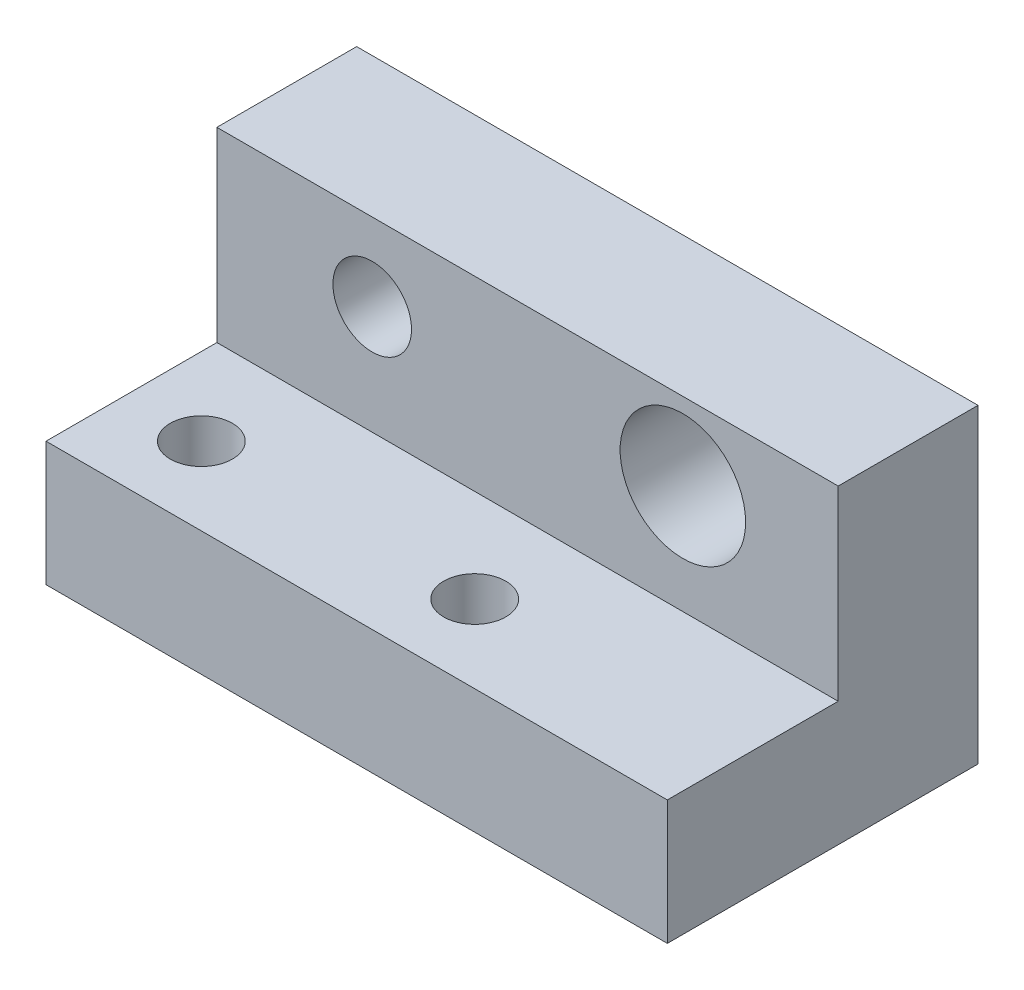
ISO-10303-21;
HEADER;
FILE_DESCRIPTION(('STEP AP214'),'2;1');
FILE_NAME('part.step','',(''),(''),'','','');
FILE_SCHEMA(('AUTOMOTIVE_DESIGN { 1 0 10303 214 1 1 1 1 }'));
ENDSEC;
DATA;
#1=APPLICATION_CONTEXT('core data for automotive mechanical design processes');
#2=APPLICATION_PROTOCOL_DEFINITION('international standard','automotive_design',2000,#1);
#3=PRODUCT_CONTEXT('',#1,'mechanical');
#4=PRODUCT('Part','Part','',(#3));
#5=PRODUCT_RELATED_PRODUCT_CATEGORY('part','',(#4));
#6=PRODUCT_DEFINITION_FORMATION('','',#4);
#7=PRODUCT_DEFINITION_CONTEXT('part definition',#1,'design');
#8=PRODUCT_DEFINITION('design','',#6,#7);
#9=PRODUCT_DEFINITION_SHAPE('','',#8);
#10=(LENGTH_UNIT() NAMED_UNIT(*) SI_UNIT(.MILLI.,.METRE.));
#11=(NAMED_UNIT(*) PLANE_ANGLE_UNIT() SI_UNIT($,.RADIAN.));
#12=(NAMED_UNIT(*) SI_UNIT($,.STERADIAN.) SOLID_ANGLE_UNIT());
#13=UNCERTAINTY_MEASURE_WITH_UNIT(LENGTH_MEASURE(1.E-05),#10,'distance_accuracy_value','');
#14=(GEOMETRIC_REPRESENTATION_CONTEXT(3) GLOBAL_UNCERTAINTY_ASSIGNED_CONTEXT((#13)) GLOBAL_UNIT_ASSIGNED_CONTEXT((#10,
#11,#12)) REPRESENTATION_CONTEXT('',''));
#15=CARTESIAN_POINT('',(0.,0.,0.));
#16=DIRECTION('',(0.,0.,1.));
#17=DIRECTION('',(1.,0.,0.));
#18=AXIS2_PLACEMENT_3D('',#15,#16,#17);
#19=CARTESIAN_POINT('',(-50.8,10.16,0.));
#20=DIRECTION('',(0.,0.,1.));
#21=DIRECTION('',(1.,0.,0.));
#22=AXIS2_PLACEMENT_3D('',#19,#20,#21);
#23=PLANE('',#22);
#24=DIRECTION('',(0.,-1.,0.));
#25=VECTOR('',#24,1.);
#26=CARTESIAN_POINT('',(0.,10.16,0.));
#27=LINE('',#26,#25);
#28=CARTESIAN_POINT('',(0.,10.16,0.));
#29=VERTEX_POINT('',#28);
#30=CARTESIAN_POINT('',(0.,0.,0.));
#31=VERTEX_POINT('',#30);
#32=EDGE_CURVE('E118',#29,#31,#27,.T.);
#33=ORIENTED_EDGE('',*,*,#32,.F.);
#34=DIRECTION('',(1.,0.,0.));
#35=VECTOR('',#34,1.);
#36=CARTESIAN_POINT('',(-50.8,10.16,0.));
#37=LINE('',#36,#35);
#38=CARTESIAN_POINT('',(-50.8,10.16,0.));
#39=VERTEX_POINT('',#38);
#40=EDGE_CURVE('E11',#39,#29,#37,.T.);
#41=ORIENTED_EDGE('',*,*,#40,.F.);
#42=DIRECTION('',(0.,-1.,0.));
#43=VECTOR('',#42,1.);
#44=CARTESIAN_POINT('',(-50.8,10.16,0.));
#45=LINE('',#44,#43);
#46=CARTESIAN_POINT('',(-50.8,0.,0.));
#47=VERTEX_POINT('',#46);
#48=EDGE_CURVE('E133',#39,#47,#45,.T.);
#49=ORIENTED_EDGE('',*,*,#48,.T.);
#50=DIRECTION('',(1.,0.,0.));
#51=VECTOR('',#50,1.);
#52=CARTESIAN_POINT('',(-50.8,0.,0.));
#53=LINE('',#52,#51);
#54=EDGE_CURVE('E82',#47,#31,#53,.T.);
#55=ORIENTED_EDGE('',*,*,#54,.T.);
#56=EDGE_LOOP('',(#33,#41,#49,#55));
#57=FACE_BOUND('',#56,.T.);
#58=ADVANCED_FACE('F32',(#57),#23,.T.);
#59=CARTESIAN_POINT('',(-50.8,10.16,-13.97));
#60=DIRECTION('',(0.,1.,0.));
#61=DIRECTION('',(0.,0.,1.));
#62=AXIS2_PLACEMENT_3D('',#59,#60,#61);
#63=PLANE('',#62);
#64=CARTESIAN_POINT('',(-44.45,10.16,-6.35));
#65=DIRECTION('',(0.,1.,0.));
#66=DIRECTION('',(0.,0.,1.));
#67=AXIS2_PLACEMENT_3D('',#64,#65,#66);
#68=CIRCLE('',#67,2.54);
#69=CARTESIAN_POINT('',(-44.45,10.16,-3.81));
#70=VERTEX_POINT('',#69);
#71=EDGE_CURVE('E156',#70,#70,#68,.T.);
#72=ORIENTED_EDGE('',*,*,#71,.F.);
#73=EDGE_LOOP('',(#72));
#74=FACE_BOUND('',#73,.T.);
#75=CARTESIAN_POINT('',(-22.098,10.16,-6.35));
#76=DIRECTION('',(0.,1.,0.));
#77=DIRECTION('',(0.,0.,1.));
#78=AXIS2_PLACEMENT_3D('',#75,#76,#77);
#79=CIRCLE('',#78,2.54);
#80=CARTESIAN_POINT('',(-22.098,10.16,-3.81));
#81=VERTEX_POINT('',#80);
#82=EDGE_CURVE('E145',#81,#81,#79,.T.);
#83=ORIENTED_EDGE('',*,*,#82,.F.);
#84=EDGE_LOOP('',(#83));
#85=FACE_BOUND('',#84,.T.);
#86=DIRECTION('',(0.,0.,1.));
#87=VECTOR('',#86,1.);
#88=CARTESIAN_POINT('',(0.,10.16,-13.97));
#89=LINE('',#88,#87);
#90=CARTESIAN_POINT('',(0.,10.16,-13.97));
#91=VERTEX_POINT('',#90);
#92=EDGE_CURVE('E131',#91,#29,#89,.T.);
#93=ORIENTED_EDGE('',*,*,#92,.F.);
#94=DIRECTION('',(1.,0.,0.));
#95=VECTOR('',#94,1.);
#96=CARTESIAN_POINT('',(-50.8,10.16,-13.97));
#97=LINE('',#96,#95);
#98=CARTESIAN_POINT('',(-50.8,10.16,-13.97));
#99=VERTEX_POINT('',#98);
#100=EDGE_CURVE('E41',#99,#91,#97,.T.);
#101=ORIENTED_EDGE('',*,*,#100,.F.);
#102=DIRECTION('',(0.,0.,1.));
#103=VECTOR('',#102,1.);
#104=CARTESIAN_POINT('',(-50.8,10.16,-13.97));
#105=LINE('',#104,#103);
#106=EDGE_CURVE('E108',#99,#39,#105,.T.);
#107=ORIENTED_EDGE('',*,*,#106,.T.);
#108=ORIENTED_EDGE('',*,*,#40,.T.);
#109=EDGE_LOOP('',(#93,#101,#107,#108));
#110=FACE_BOUND('',#109,.T.);
#111=ADVANCED_FACE('F168',(#74,#85,#110),#63,.T.);
#112=CARTESIAN_POINT('',(-50.8,25.4,-13.97));
#113=DIRECTION('',(0.,0.,1.));
#114=DIRECTION('',(0.,-1.,0.));
#115=AXIS2_PLACEMENT_3D('',#112,#113,#114);
#116=PLANE('',#115);
#117=CARTESIAN_POINT('',(-38.1,19.05,-13.97));
#118=DIRECTION('',(0.,0.,1.));
#119=DIRECTION('',(1.,0.,0.));
#120=AXIS2_PLACEMENT_3D('',#117,#118,#119);
#121=CIRCLE('',#120,3.2131);
#122=CARTESIAN_POINT('',(-34.8869,19.05,-13.97));
#123=VERTEX_POINT('',#122);
#124=EDGE_CURVE('E141',#123,#123,#121,.T.);
#125=ORIENTED_EDGE('',*,*,#124,.F.);
#126=EDGE_LOOP('',(#125));
#127=FACE_BOUND('',#126,.T.);
#128=CARTESIAN_POINT('',(-12.7,19.05,-13.97));
#129=DIRECTION('',(0.,0.,1.));
#130=DIRECTION('',(1.,0.,0.));
#131=AXIS2_PLACEMENT_3D('',#128,#129,#130);
#132=CIRCLE('',#131,5.1308);
#133=CARTESIAN_POINT('',(-7.5692,19.05,-13.97));
#134=VERTEX_POINT('',#133);
#135=EDGE_CURVE('E147',#134,#134,#132,.T.);
#136=ORIENTED_EDGE('',*,*,#135,.F.);
#137=EDGE_LOOP('',(#136));
#138=FACE_BOUND('',#137,.T.);
#139=DIRECTION('',(0.,-1.,0.));
#140=VECTOR('',#139,1.);
#141=CARTESIAN_POINT('',(0.,25.4,-13.97));
#142=LINE('',#141,#140);
#143=CARTESIAN_POINT('',(0.,25.4,-13.97));
#144=VERTEX_POINT('',#143);
#145=EDGE_CURVE('E95',#144,#91,#142,.T.);
#146=ORIENTED_EDGE('',*,*,#145,.F.);
#147=DIRECTION('',(1.,0.,0.));
#148=VECTOR('',#147,1.);
#149=CARTESIAN_POINT('',(-50.8,25.4,-13.97));
#150=LINE('',#149,#148);
#151=CARTESIAN_POINT('',(-50.8,25.4,-13.97));
#152=VERTEX_POINT('',#151);
#153=EDGE_CURVE('E90',#152,#144,#150,.T.);
#154=ORIENTED_EDGE('',*,*,#153,.F.);
#155=DIRECTION('',(0.,-1.,0.));
#156=VECTOR('',#155,1.);
#157=CARTESIAN_POINT('',(-50.8,25.4,-13.97));
#158=LINE('',#157,#156);
#159=EDGE_CURVE('E93',#152,#99,#158,.T.);
#160=ORIENTED_EDGE('',*,*,#159,.T.);
#161=ORIENTED_EDGE('',*,*,#100,.T.);
#162=EDGE_LOOP('',(#146,#154,#160,#161));
#163=FACE_BOUND('',#162,.T.);
#164=ADVANCED_FACE('F92',(#127,#138,#163),#116,.T.);
#165=CARTESIAN_POINT('',(-50.8,25.4,-25.4));
#166=DIRECTION('',(0.,1.,0.));
#167=DIRECTION('',(0.,0.,1.));
#168=AXIS2_PLACEMENT_3D('',#165,#166,#167);
#169=PLANE('',#168);
#170=DIRECTION('',(0.,0.,1.));
#171=VECTOR('',#170,1.);
#172=CARTESIAN_POINT('',(0.,25.4,-25.4));
#173=LINE('',#172,#171);
#174=CARTESIAN_POINT('',(0.,25.4,-25.4));
#175=VERTEX_POINT('',#174);
#176=EDGE_CURVE('E128',#175,#144,#173,.T.);
#177=ORIENTED_EDGE('',*,*,#176,.F.);
#178=DIRECTION('',(1.,0.,0.));
#179=VECTOR('',#178,1.);
#180=CARTESIAN_POINT('',(-50.8,25.4,-25.4));
#181=LINE('',#180,#179);
#182=CARTESIAN_POINT('',(-50.8,25.4,-25.4));
#183=VERTEX_POINT('',#182);
#184=EDGE_CURVE('E100',#183,#175,#181,.T.);
#185=ORIENTED_EDGE('',*,*,#184,.F.);
#186=DIRECTION('',(0.,0.,1.));
#187=VECTOR('',#186,1.);
#188=CARTESIAN_POINT('',(-50.8,25.4,-25.4));
#189=LINE('',#188,#187);
#190=EDGE_CURVE('E106',#183,#152,#189,.T.);
#191=ORIENTED_EDGE('',*,*,#190,.T.);
#192=ORIENTED_EDGE('',*,*,#153,.T.);
#193=EDGE_LOOP('',(#177,#185,#191,#192));
#194=FACE_BOUND('',#193,.T.);
#195=ADVANCED_FACE('F110',(#194),#169,.T.);
#196=CARTESIAN_POINT('',(-50.8,0.,-25.4));
#197=DIRECTION('',(0.,0.,-1.));
#198=DIRECTION('',(-1.,0.,0.));
#199=AXIS2_PLACEMENT_3D('',#196,#197,#198);
#200=PLANE('',#199);
#201=CARTESIAN_POINT('',(-38.1,19.05,-25.4));
#202=DIRECTION('',(0.,0.,-1.));
#203=DIRECTION('',(-1.,0.,0.));
#204=AXIS2_PLACEMENT_3D('',#201,#202,#203);
#205=CIRCLE('',#204,3.2131);
#206=CARTESIAN_POINT('',(-41.3131,19.05,-25.4));
#207=VERTEX_POINT('',#206);
#208=EDGE_CURVE('E35',#207,#207,#205,.T.);
#209=ORIENTED_EDGE('',*,*,#208,.F.);
#210=EDGE_LOOP('',(#209));
#211=FACE_BOUND('',#210,.T.);
#212=CARTESIAN_POINT('',(-12.7,19.05,-25.4));
#213=DIRECTION('',(0.,0.,-1.));
#214=DIRECTION('',(-1.,0.,0.));
#215=AXIS2_PLACEMENT_3D('',#212,#213,#214);
#216=CIRCLE('',#215,5.1308);
#217=CARTESIAN_POINT('',(-17.8308,19.05,-25.4));
#218=VERTEX_POINT('',#217);
#219=EDGE_CURVE('E139',#218,#218,#216,.T.);
#220=ORIENTED_EDGE('',*,*,#219,.F.);
#221=EDGE_LOOP('',(#220));
#222=FACE_BOUND('',#221,.T.);
#223=DIRECTION('',(0.,1.,0.));
#224=VECTOR('',#223,1.);
#225=CARTESIAN_POINT('',(0.,0.,-25.4));
#226=LINE('',#225,#224);
#227=CARTESIAN_POINT('',(0.,0.,-25.4));
#228=VERTEX_POINT('',#227);
#229=EDGE_CURVE('E125',#228,#175,#226,.T.);
#230=ORIENTED_EDGE('',*,*,#229,.F.);
#231=DIRECTION('',(1.,0.,0.));
#232=VECTOR('',#231,1.);
#233=CARTESIAN_POINT('',(-50.8,0.,-25.4));
#234=LINE('',#233,#232);
#235=CARTESIAN_POINT('',(-50.8,0.,-25.4));
#236=VERTEX_POINT('',#235);
#237=EDGE_CURVE('E137',#236,#228,#234,.T.);
#238=ORIENTED_EDGE('',*,*,#237,.F.);
#239=DIRECTION('',(0.,1.,0.));
#240=VECTOR('',#239,1.);
#241=CARTESIAN_POINT('',(-50.8,0.,-25.4));
#242=LINE('',#241,#240);
#243=EDGE_CURVE('E111',#236,#183,#242,.T.);
#244=ORIENTED_EDGE('',*,*,#243,.T.);
#245=ORIENTED_EDGE('',*,*,#184,.T.);
#246=EDGE_LOOP('',(#230,#238,#244,#245));
#247=FACE_BOUND('',#246,.T.);
#248=ADVANCED_FACE('F185',(#211,#222,#247),#200,.T.);
#249=CARTESIAN_POINT('',(-50.8,0.,0.));
#250=DIRECTION('',(0.,-1.,0.));
#251=DIRECTION('',(0.,0.,-1.));
#252=AXIS2_PLACEMENT_3D('',#249,#250,#251);
#253=PLANE('',#252);
#254=CARTESIAN_POINT('',(-44.45,0.,-6.35));
#255=DIRECTION('',(0.,1.,0.));
#256=DIRECTION('',(0.,0.,1.));
#257=AXIS2_PLACEMENT_3D('',#254,#255,#256);
#258=CIRCLE('',#257,2.54);
#259=CARTESIAN_POINT('',(-44.45,0.,-3.81));
#260=VERTEX_POINT('',#259);
#261=EDGE_CURVE('E122',#260,#260,#258,.T.);
#262=ORIENTED_EDGE('',*,*,#261,.T.);
#263=EDGE_LOOP('',(#262));
#264=FACE_BOUND('',#263,.T.);
#265=CARTESIAN_POINT('',(-22.098,0.,-6.35));
#266=DIRECTION('',(0.,1.,0.));
#267=DIRECTION('',(0.,0.,1.));
#268=AXIS2_PLACEMENT_3D('',#265,#266,#267);
#269=CIRCLE('',#268,2.54);
#270=CARTESIAN_POINT('',(-22.098,0.,-3.81));
#271=VERTEX_POINT('',#270);
#272=EDGE_CURVE('E159',#271,#271,#269,.T.);
#273=ORIENTED_EDGE('',*,*,#272,.T.);
#274=EDGE_LOOP('',(#273));
#275=FACE_BOUND('',#274,.T.);
#276=DIRECTION('',(0.,0.,-1.));
#277=VECTOR('',#276,1.);
#278=CARTESIAN_POINT('',(0.,0.,0.));
#279=LINE('',#278,#277);
#280=EDGE_CURVE('E121',#31,#228,#279,.T.);
#281=ORIENTED_EDGE('',*,*,#280,.F.);
#282=ORIENTED_EDGE('',*,*,#54,.F.);
#283=DIRECTION('',(0.,0.,-1.));
#284=VECTOR('',#283,1.);
#285=CARTESIAN_POINT('',(-50.8,0.,0.));
#286=LINE('',#285,#284);
#287=EDGE_CURVE('E113',#47,#236,#286,.T.);
#288=ORIENTED_EDGE('',*,*,#287,.T.);
#289=ORIENTED_EDGE('',*,*,#237,.T.);
#290=EDGE_LOOP('',(#281,#282,#288,#289));
#291=FACE_BOUND('',#290,.T.);
#292=ADVANCED_FACE('F164',(#264,#275,#291),#253,.T.);
#293=CARTESIAN_POINT('',(-50.8,0.,0.));
#294=DIRECTION('',(1.,0.,0.));
#295=DIRECTION('',(0.,0.,-1.));
#296=AXIS2_PLACEMENT_3D('',#293,#294,#295);
#297=PLANE('',#296);
#298=ORIENTED_EDGE('',*,*,#48,.F.);
#299=ORIENTED_EDGE('',*,*,#106,.F.);
#300=ORIENTED_EDGE('',*,*,#159,.F.);
#301=ORIENTED_EDGE('',*,*,#190,.F.);
#302=ORIENTED_EDGE('',*,*,#243,.F.);
#303=ORIENTED_EDGE('',*,*,#287,.F.);
#304=EDGE_LOOP('',(#298,#299,#300,#301,#302,#303));
#305=FACE_BOUND('',#304,.T.);
#306=ADVANCED_FACE('F104',(#305),#297,.F.);
#307=CARTESIAN_POINT('',(0.,0.,0.));
#308=DIRECTION('',(1.,0.,0.));
#309=DIRECTION('',(0.,0.,-1.));
#310=AXIS2_PLACEMENT_3D('',#307,#308,#309);
#311=PLANE('',#310);
#312=ORIENTED_EDGE('',*,*,#32,.T.);
#313=ORIENTED_EDGE('',*,*,#280,.T.);
#314=ORIENTED_EDGE('',*,*,#229,.T.);
#315=ORIENTED_EDGE('',*,*,#176,.T.);
#316=ORIENTED_EDGE('',*,*,#145,.T.);
#317=ORIENTED_EDGE('',*,*,#92,.T.);
#318=EDGE_LOOP('',(#312,#313,#314,#315,#316,#317));
#319=FACE_BOUND('',#318,.T.);
#320=ADVANCED_FACE('F167',(#319),#311,.T.);
#321=CARTESIAN_POINT('',(-22.098,0.,-6.35));
#322=DIRECTION('',(0.,1.,0.));
#323=DIRECTION('',(0.,0.,1.));
#324=AXIS2_PLACEMENT_3D('',#321,#322,#323);
#325=CYLINDRICAL_SURFACE('',#324,2.54);
#326=ORIENTED_EDGE('',*,*,#272,.F.);
#327=EDGE_LOOP('',(#326));
#328=FACE_BOUND('',#327,.T.);
#329=ORIENTED_EDGE('',*,*,#82,.T.);
#330=EDGE_LOOP('',(#329));
#331=FACE_BOUND('',#330,.T.);
#332=ADVANCED_FACE('F197',(#328,#331),#325,.F.);
#333=CARTESIAN_POINT('',(-44.45,0.,-6.35));
#334=DIRECTION('',(0.,1.,0.));
#335=DIRECTION('',(0.,0.,1.));
#336=AXIS2_PLACEMENT_3D('',#333,#334,#335);
#337=CYLINDRICAL_SURFACE('',#336,2.54);
#338=ORIENTED_EDGE('',*,*,#261,.F.);
#339=EDGE_LOOP('',(#338));
#340=FACE_BOUND('',#339,.T.);
#341=ORIENTED_EDGE('',*,*,#71,.T.);
#342=EDGE_LOOP('',(#341));
#343=FACE_BOUND('',#342,.T.);
#344=ADVANCED_FACE('F200',(#340,#343),#337,.F.);
#345=CARTESIAN_POINT('',(-12.7,19.05,-64.77));
#346=DIRECTION('',(0.,0.,1.));
#347=DIRECTION('',(1.,0.,0.));
#348=AXIS2_PLACEMENT_3D('',#345,#346,#347);
#349=CYLINDRICAL_SURFACE('',#348,5.1308);
#350=ORIENTED_EDGE('',*,*,#219,.T.);
#351=EDGE_LOOP('',(#350));
#352=FACE_BOUND('',#351,.T.);
#353=ORIENTED_EDGE('',*,*,#135,.T.);
#354=EDGE_LOOP('',(#353));
#355=FACE_BOUND('',#354,.T.);
#356=ADVANCED_FACE('F207',(#352,#355),#349,.F.);
#357=CARTESIAN_POINT('',(-38.1,19.05,-64.77));
#358=DIRECTION('',(0.,0.,1.));
#359=DIRECTION('',(1.,0.,0.));
#360=AXIS2_PLACEMENT_3D('',#357,#358,#359);
#361=CYLINDRICAL_SURFACE('',#360,3.2131);
#362=ORIENTED_EDGE('',*,*,#208,.T.);
#363=EDGE_LOOP('',(#362));
#364=FACE_BOUND('',#363,.T.);
#365=ORIENTED_EDGE('',*,*,#124,.T.);
#366=EDGE_LOOP('',(#365));
#367=FACE_BOUND('',#366,.T.);
#368=ADVANCED_FACE('F213',(#364,#367),#361,.F.);
#369=CLOSED_SHELL('',(#58,#111,#164,#195,#248,#292,#306,#320,#332,#344,#356,#368));
#370=MANIFOLD_SOLID_BREP('B2',#369);
#371=ADVANCED_BREP_SHAPE_REPRESENTATION('',(#18,#370),#14);
#372=SHAPE_DEFINITION_REPRESENTATION(#9,#371);
ENDSEC;
END-ISO-10303-21;
